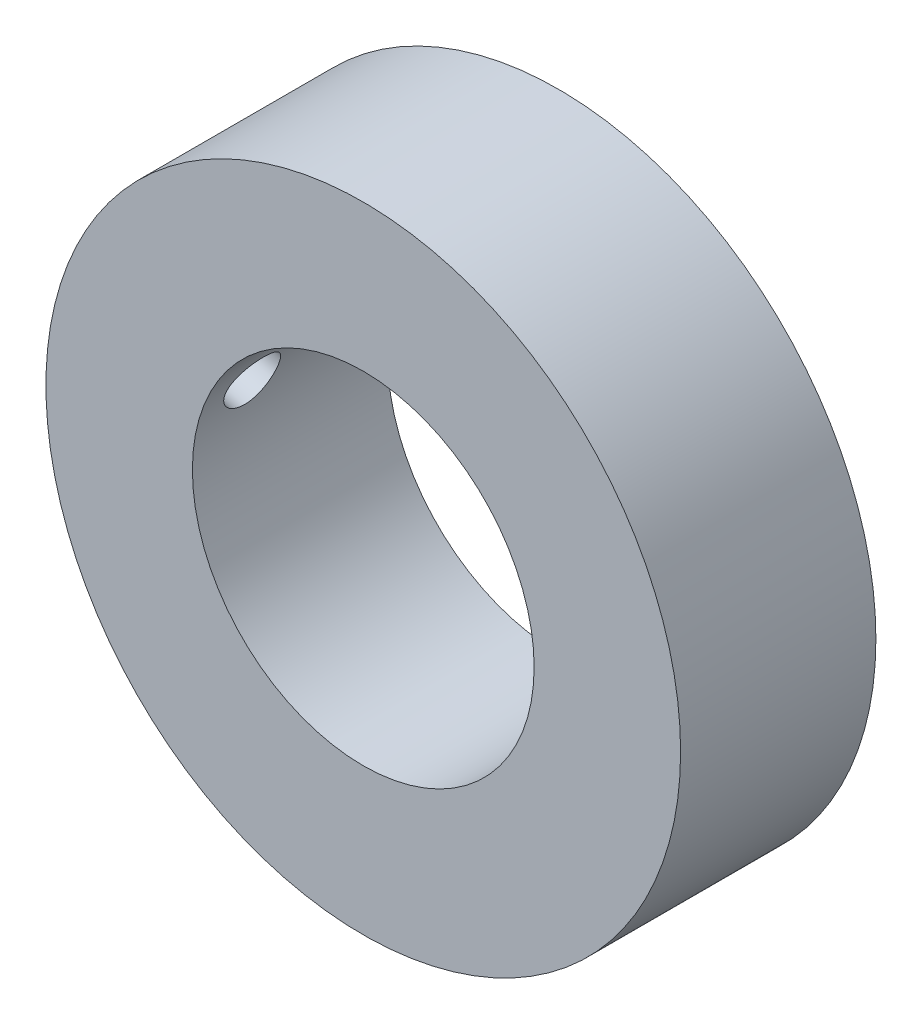
ISO-10303-21;
HEADER;
FILE_DESCRIPTION(('STEP AP214'),'2;1');
FILE_NAME('part.step','',(''),(''),'','','');
FILE_SCHEMA(('AUTOMOTIVE_DESIGN { 1 0 10303 214 1 1 1 1 }'));
ENDSEC;
DATA;
#1=APPLICATION_CONTEXT('core data for automotive mechanical design processes');
#2=APPLICATION_PROTOCOL_DEFINITION('international standard','automotive_design',2000,#1);
#3=PRODUCT_CONTEXT('',#1,'mechanical');
#4=PRODUCT('Part','Part','',(#3));
#5=PRODUCT_RELATED_PRODUCT_CATEGORY('part','',(#4));
#6=PRODUCT_DEFINITION_FORMATION('','',#4);
#7=PRODUCT_DEFINITION_CONTEXT('part definition',#1,'design');
#8=PRODUCT_DEFINITION('design','',#6,#7);
#9=PRODUCT_DEFINITION_SHAPE('','',#8);
#10=(LENGTH_UNIT() NAMED_UNIT(*) SI_UNIT(.MILLI.,.METRE.));
#11=(NAMED_UNIT(*) PLANE_ANGLE_UNIT() SI_UNIT($,.RADIAN.));
#12=(NAMED_UNIT(*) SI_UNIT($,.STERADIAN.) SOLID_ANGLE_UNIT());
#13=UNCERTAINTY_MEASURE_WITH_UNIT(LENGTH_MEASURE(1.E-05),#10,'distance_accuracy_value','');
#14=(GEOMETRIC_REPRESENTATION_CONTEXT(3) GLOBAL_UNCERTAINTY_ASSIGNED_CONTEXT((#13)) GLOBAL_UNIT_ASSIGNED_CONTEXT((#10,
#11,#12)) REPRESENTATION_CONTEXT('',''));
#15=CARTESIAN_POINT('',(0.,0.,0.));
#16=DIRECTION('',(0.,0.,1.));
#17=DIRECTION('',(1.,0.,0.));
#18=AXIS2_PLACEMENT_3D('',#15,#16,#17);
#19=CARTESIAN_POINT('',(0.,0.,20.));
#20=DIRECTION('',(0.,0.,1.));
#21=DIRECTION('',(1.,0.,0.));
#22=AXIS2_PLACEMENT_3D('',#19,#20,#21);
#23=PLANE('',#22);
#24=CARTESIAN_POINT('',(0.,0.,20.));
#25=DIRECTION('',(0.,0.,1.));
#26=DIRECTION('',(1.,0.,0.));
#27=AXIS2_PLACEMENT_3D('',#24,#25,#26);
#28=CIRCLE('',#27,32.5);
#29=CARTESIAN_POINT('',(32.5,0.,20.));
#30=VERTEX_POINT('',#29);
#31=EDGE_CURVE('E10',#30,#30,#28,.T.);
#32=ORIENTED_EDGE('',*,*,#31,.T.);
#33=EDGE_LOOP('',(#32));
#34=FACE_BOUND('',#33,.T.);
#35=CARTESIAN_POINT('',(0.,0.,20.));
#36=DIRECTION('',(0.,0.,1.));
#37=DIRECTION('',(1.,0.,0.));
#38=AXIS2_PLACEMENT_3D('',#35,#36,#37);
#39=CIRCLE('',#38,17.5);
#40=CARTESIAN_POINT('',(17.5,0.,20.));
#41=VERTEX_POINT('',#40);
#42=EDGE_CURVE('E41',#41,#41,#39,.T.);
#43=ORIENTED_EDGE('',*,*,#42,.F.);
#44=EDGE_LOOP('',(#43));
#45=FACE_BOUND('',#44,.T.);
#46=ADVANCED_FACE('F29',(#34,#45),#23,.T.);
#47=CARTESIAN_POINT('',(0.,0.,0.));
#48=DIRECTION('',(0.,0.,1.));
#49=DIRECTION('',(1.,0.,0.));
#50=AXIS2_PLACEMENT_3D('',#47,#48,#49);
#51=PLANE('',#50);
#52=CARTESIAN_POINT('',(0.,0.,0.));
#53=DIRECTION('',(0.,0.,1.));
#54=DIRECTION('',(1.,0.,0.));
#55=AXIS2_PLACEMENT_3D('',#52,#53,#54);
#56=CIRCLE('',#55,32.5);
#57=CARTESIAN_POINT('',(32.5,0.,0.));
#58=VERTEX_POINT('',#57);
#59=EDGE_CURVE('E34',#58,#58,#56,.T.);
#60=ORIENTED_EDGE('',*,*,#59,.F.);
#61=EDGE_LOOP('',(#60));
#62=FACE_BOUND('',#61,.T.);
#63=CARTESIAN_POINT('',(0.,0.,0.));
#64=DIRECTION('',(0.,0.,1.));
#65=DIRECTION('',(1.,0.,0.));
#66=AXIS2_PLACEMENT_3D('',#63,#64,#65);
#67=CIRCLE('',#66,17.5);
#68=CARTESIAN_POINT('',(17.5,0.,0.));
#69=VERTEX_POINT('',#68);
#70=EDGE_CURVE('E43',#69,#69,#67,.T.);
#71=ORIENTED_EDGE('',*,*,#70,.T.);
#72=EDGE_LOOP('',(#71));
#73=FACE_BOUND('',#72,.T.);
#74=ADVANCED_FACE('F70',(#62,#73),#51,.F.);
#75=CARTESIAN_POINT('',(0.,0.,20.));
#76=DIRECTION('',(0.,0.,-1.));
#77=DIRECTION('',(-1.,0.,0.));
#78=AXIS2_PLACEMENT_3D('',#75,#76,#77);
#79=CYLINDRICAL_SURFACE('',#78,32.5);
#80=CARTESIAN_POINT('',(-31.6580099535561,7.34985753471055,15.));
#81=CARTESIAN_POINT('',(-31.6580093802729,7.34986428908865,14.8455507950187));
#82=CARTESIAN_POINT('',(-31.6550638377086,7.36258326980799,14.6909969096927));
#83=CARTESIAN_POINT('',(-31.6432667922846,7.41311771583208,14.3861564829485));
#84=CARTESIAN_POINT('',(-31.6344086225891,7.45096151058809,14.2358749585229));
#85=CARTESIAN_POINT('',(-31.6107756192043,7.55059408325607,13.9440289830093));
#86=CARTESIAN_POINT('',(-31.5960035757084,7.61237156869713,13.8024604573769));
#87=CARTESIAN_POINT('',(-31.5605619112965,7.75799719400248,13.5320250370912));
#88=CARTESIAN_POINT('',(-31.539893624076,7.84184034241233,13.4031552789107));
#89=CARTESIAN_POINT('',(-31.4927338134435,8.02913562949807,13.1616758419426));
#90=CARTESIAN_POINT('',(-31.4662398270969,8.13259605922998,13.0490730738244));
#91=CARTESIAN_POINT('',(-31.4076444252093,8.35602665612486,12.8433906633212));
#92=CARTESIAN_POINT('',(-31.3755428546516,8.47599727967805,12.7503115608071));
#93=CARTESIAN_POINT('',(-31.3061620299281,8.72876580587809,12.5864119884151));
#94=CARTESIAN_POINT('',(-31.2688878887837,8.86155100247904,12.5155697605134));
#95=CARTESIAN_POINT('',(-31.1897641710468,9.1361372622676,12.398032072969));
#96=CARTESIAN_POINT('',(-31.1479146782972,9.27793816022355,12.3513361709373));
#97=CARTESIAN_POINT('',(-31.0606081911833,9.56615063482706,12.2834598743729));
#98=CARTESIAN_POINT('',(-31.0151579534276,9.71255327896088,12.2622328435693));
#99=CARTESIAN_POINT('',(-30.9217307108764,10.0060121502412,12.2456958992536));
#100=CARTESIAN_POINT('',(-30.8737537011059,10.1530683786739,12.2503860367711));
#101=CARTESIAN_POINT('',(-30.7766081165035,10.4438461426784,12.28551130667));
#102=CARTESIAN_POINT('',(-30.7274383105494,10.5875639046104,12.3159742427209));
#103=CARTESIAN_POINT('',(-30.6295400089768,10.8675336598563,12.4017673590155));
#104=CARTESIAN_POINT('',(-30.5808115283041,11.0037854011098,12.4570983782508));
#105=CARTESIAN_POINT('',(-30.4852732319771,11.2657743768856,12.5913724261544));
#106=CARTESIAN_POINT('',(-30.4384738968807,11.3914572684525,12.6704289495366));
#107=CARTESIAN_POINT('',(-30.3488267571219,11.6281882373069,12.8498330412042));
#108=CARTESIAN_POINT('',(-30.3059790603163,11.7392359151742,12.9501811903798));
#109=CARTESIAN_POINT('',(-30.225843923756,11.9440579125522,13.169738923299));
#110=CARTESIAN_POINT('',(-30.1885749186195,12.0377751943826,13.2890084697985));
#111=CARTESIAN_POINT('',(-30.1213775432119,12.2049481277447,13.5428387293097));
#112=CARTESIAN_POINT('',(-30.0914490180463,12.2784042068205,13.6773991195753));
#113=CARTESIAN_POINT('',(-30.0403955941604,12.4027882972028,13.9574604838955));
#114=CARTESIAN_POINT('',(-30.0192367653618,12.4538031817379,14.1029166714446));
#115=CARTESIAN_POINT('',(-29.9865535514953,12.5322955231584,14.4010804687608));
#116=CARTESIAN_POINT('',(-29.9750286378317,12.5597742714312,14.5537876801913));
#117=CARTESIAN_POINT('',(-29.9622228044505,12.5902931139594,14.8607874754793));
#118=CARTESIAN_POINT('',(-29.960859320166,12.5935301799779,15.015057059526));
#119=CARTESIAN_POINT('',(-29.9682238328854,12.5759948946539,15.3219791010538));
#120=CARTESIAN_POINT('',(-29.9769515897467,12.555223114653,15.4746315969296));
#121=CARTESIAN_POINT('',(-30.0040356860676,12.4903586419519,15.773488231737));
#122=CARTESIAN_POINT('',(-30.0223610252911,12.446341029602,15.9197114983901));
#123=CARTESIAN_POINT('',(-30.0677689959859,12.3362390228379,16.2021454430763));
#124=CARTESIAN_POINT('',(-30.094851891867,12.2701539621575,16.3383558186461));
#125=CARTESIAN_POINT('',(-30.1567318487497,12.1172742883074,16.597722329548));
#126=CARTESIAN_POINT('',(-30.1915704077724,12.0303680697547,16.7208027632359));
#127=CARTESIAN_POINT('',(-30.2673734109329,11.838358589614,16.9496696632692));
#128=CARTESIAN_POINT('',(-30.3083381476226,11.7332544589579,17.055455303207));
#129=CARTESIAN_POINT('',(-30.3950587973819,11.5067455362582,17.2475784455559));
#130=CARTESIAN_POINT('',(-30.440849425856,11.3852205707611,17.3337586466911));
#131=CARTESIAN_POINT('',(-30.5351722595844,11.1297695341231,17.4831941857703));
#132=CARTESIAN_POINT('',(-30.5837044971228,10.9958433169385,17.5464492536926));
#133=CARTESIAN_POINT('',(-30.6818346392059,10.7189837451152,17.6483116956977));
#134=CARTESIAN_POINT('',(-30.731434287775,10.5760347734429,17.6868749712148));
#135=CARTESIAN_POINT('',(-30.8299448957378,10.2853312658506,17.7380183873072));
#136=CARTESIAN_POINT('',(-30.8788558721176,10.1375768487543,17.7505991698538));
#137=CARTESIAN_POINT('',(-30.9742879811917,9.84212775161306,17.74935962197));
#138=CARTESIAN_POINT('',(-31.0208187050486,9.69443568368829,17.7356555184329));
#139=CARTESIAN_POINT('',(-31.1104824343818,9.40272166294711,17.6824180050779));
#140=CARTESIAN_POINT('',(-31.1536155148124,9.25869962921478,17.6428851652378));
#141=CARTESIAN_POINT('',(-31.2353435898079,8.9791122469227,17.5393074892844));
#142=CARTESIAN_POINT('',(-31.2739563822936,8.84351479159511,17.4753633234038));
#143=CARTESIAN_POINT('',(-31.3461502726266,8.58411392081663,17.3247609469892));
#144=CARTESIAN_POINT('',(-31.3797315456354,8.46031009485069,17.238103527457));
#145=CARTESIAN_POINT('',(-31.4414091674762,8.22813739147064,17.0445310623412));
#146=CARTESIAN_POINT('',(-31.4695054889975,8.11976859091136,16.9376159158956));
#147=CARTESIAN_POINT('',(-31.5199617345584,7.92164714804217,16.7065206255451));
#148=CARTESIAN_POINT('',(-31.5423202698188,7.83189901370036,16.582336312989));
#149=CARTESIAN_POINT('',(-31.581220883417,7.67353720771558,16.3199388996383));
#150=CARTESIAN_POINT('',(-31.5977491932332,7.60497361168338,16.181693570649));
#151=CARTESIAN_POINT('',(-31.6248725554863,7.49138685479662,15.8954294275032));
#152=CARTESIAN_POINT('',(-31.6354742685854,7.44633727128738,15.7474217948865));
#153=CARTESIAN_POINT('',(-31.6480877797769,7.39249507888641,15.4988025747701));
#154=CARTESIAN_POINT('',(-31.6518080802968,7.37652810554525,15.399769262644));
#155=CARTESIAN_POINT('',(-31.6567693531161,7.35520714157473,15.2005053416351));
#156=CARTESIAN_POINT('',(-31.658010325755,7.34985314949238,15.1002747329162));
#157=CARTESIAN_POINT('',(-31.6580099535561,7.34985753471055,15.));
#158=B_SPLINE_CURVE_WITH_KNOTS('',3,(#80,#81,#82,#83,#84,#85,#86,#87,#88,#89,#90,#91,#92,#93,
#94,#95,#96,#97,#98,#99,#100,#101,#102,#103,#104,#105,#106,#107,#108,#109,#110,#111,#112,#113,
#114,#115,#116,#117,#118,#119,#120,#121,#122,#123,#124,#125,#126,#127,#128,#129,#130,#131,#132,
#133,#134,#135,#136,#137,#138,#139,#140,#141,#142,#143,#144,#145,#146,#147,#148,#149,#150,#151,
#152,#153,#154,#155,#156,#157),.UNSPECIFIED.,.T.,.F.,(4,2,2,2,2,2,2,2,2,2,2,2,2,2,2,2,2,2,2,2,2,
2,2,2,2,2,2,2,2,2,2,2,2,2,2,2,2,2,4),(0.,0.46298232345098,0.926487570631496,1.38977439109223,
1.85295650178824,2.31633481007994,2.77972593008149,3.2426622140073,3.70559001609808,
4.16766884705827,4.62974858782844,5.09232745633577,5.55492193235533,6.01976556469957,
6.48462188080152,6.95098190960408,7.41733209670479,7.88186073477829,8.3463638833287,
8.80708865099173,9.26780245495647,9.72703724609879,10.1862859038319,10.6480535788622,
11.1098433123745,11.575216831378,12.0405958315624,12.5068036788629,12.9730000070371,
13.4371396529722,13.901269056812,14.363504752721,14.8257243531523,15.2879462550091,
15.750279928188,16.2136982407338,16.6765946837254,16.9771817614673,17.2777687980568),.UNSPECIFIED.);
#159=CARTESIAN_POINT('',(-31.6580099535561,7.34985753471055,15.));
#160=VERTEX_POINT('',#159);
#161=EDGE_CURVE('E46',#160,#160,#158,.T.);
#162=ORIENTED_EDGE('',*,*,#161,.T.);
#163=EDGE_LOOP('',(#162));
#164=FACE_BOUND('',#163,.T.);
#165=ORIENTED_EDGE('',*,*,#31,.F.);
#166=EDGE_LOOP('',(#165));
#167=FACE_BOUND('',#166,.T.);
#168=ORIENTED_EDGE('',*,*,#59,.T.);
#169=EDGE_LOOP('',(#168));
#170=FACE_BOUND('',#169,.T.);
#171=ADVANCED_FACE('F31',(#164,#167,#170),#79,.T.);
#172=CARTESIAN_POINT('',(0.,0.,20.));
#173=DIRECTION('',(0.,0.,-1.));
#174=DIRECTION('',(-1.,0.,0.));
#175=AXIS2_PLACEMENT_3D('',#172,#173,#174);
#176=CYLINDRICAL_SURFACE('',#175,17.5);
#177=CARTESIAN_POINT('',(-17.1538427916572,3.46347765679383,15.));
#178=CARTESIAN_POINT('',(-17.1538431757249,3.4634840686539,14.8455986319449));
#179=CARTESIAN_POINT('',(-17.15127053917,3.47629362486233,14.6911104193291));
#180=CARTESIAN_POINT('',(-17.1408811916489,3.52715764027573,14.3864261901741));
#181=CARTESIAN_POINT('',(-17.1330595232561,3.5652359640849,14.2362343712865));
#182=CARTESIAN_POINT('',(-17.1119073461127,3.66541021239581,13.9445638722195));
#183=CARTESIAN_POINT('',(-17.0985793515415,3.72749517467879,13.8030812492678));
#184=CARTESIAN_POINT('',(-17.066045754254,3.8737146891507,13.5327852707804));
#185=CARTESIAN_POINT('',(-17.0468411608176,3.9578454547141,13.4039697447426));
#186=CARTESIAN_POINT('',(-17.0021413528646,4.14565932595845,13.1624646427161));
#187=CARTESIAN_POINT('',(-16.9766385777326,4.24936589577674,13.0497947073951));
#188=CARTESIAN_POINT('',(-16.919073368241,4.47305989625865,12.8439760738533));
#189=CARTESIAN_POINT('',(-16.887010939175,4.59304731378363,12.750827359879));
#190=CARTESIAN_POINT('',(-16.8163994315888,4.84517973059899,12.5869992452294));
#191=CARTESIAN_POINT('',(-16.7778722663549,4.97728299736405,12.516246194212));
#192=CARTESIAN_POINT('',(-16.6945635438269,5.2499375900001,12.3988012865267));
#193=CARTESIAN_POINT('',(-16.6497823440893,5.39048843264351,12.3521080550222));
#194=CARTESIAN_POINT('',(-16.55499722898,5.67489066182067,12.2842570185654));
#195=CARTESIAN_POINT('',(-16.5050277811698,5.81871586291687,12.2629411118536));
#196=CARTESIAN_POINT('',(-16.4007987447213,6.1063242061179,12.245767969512));
#197=CARTESIAN_POINT('',(-16.3465391092262,6.25010734774615,12.2499110119788));
#198=CARTESIAN_POINT('',(-16.2350986054313,6.53413624264609,12.283403291648));
#199=CARTESIAN_POINT('',(-16.1779079744968,6.67436748922324,12.3128427142704));
#200=CARTESIAN_POINT('',(-16.0626988792506,6.94705937098128,12.3960410295795));
#201=CARTESIAN_POINT('',(-16.0046803292226,7.07951919420556,12.4498024583306));
#202=CARTESIAN_POINT('',(-15.889020078903,7.33546884215141,12.5811532971801));
#203=CARTESIAN_POINT('',(-15.8314005545206,7.45877365558503,12.6591227917611));
#204=CARTESIAN_POINT('',(-15.7199448906926,7.6908996282412,12.8364224884093));
#205=CARTESIAN_POINT('',(-15.6661091514693,7.79971925640753,12.9357549456026));
#206=CARTESIAN_POINT('',(-15.564079445905,8.0013985057883,13.1544781099933));
#207=CARTESIAN_POINT('',(-15.5159605046165,8.09405208491283,13.2740941189949));
#208=CARTESIAN_POINT('',(-15.4286000939903,8.25936252399722,13.5293298933557));
#209=CARTESIAN_POINT('',(-15.3893580091342,8.33202077050308,13.6649485481036));
#210=CARTESIAN_POINT('',(-15.3223946704901,8.45452883012101,13.9466227319526));
#211=CARTESIAN_POINT('',(-15.2945335260708,8.50465640292055,14.0925239635386));
#212=CARTESIAN_POINT('',(-15.2513004404302,8.58194733676186,14.3920507121201));
#213=CARTESIAN_POINT('',(-15.2359258804932,8.60911551295031,14.5456746023212));
#214=CARTESIAN_POINT('',(-15.2188840954723,8.63920468237549,14.8515427579398));
#215=CARTESIAN_POINT('',(-15.2168355387572,8.64280024417644,15.003699734682));
#216=CARTESIAN_POINT('',(-15.2255562658,8.62742793329527,15.3064889366321));
#217=CARTESIAN_POINT('',(-15.2363245504515,8.60846181935492,15.4571212797662));
#218=CARTESIAN_POINT('',(-15.2698205636023,8.54890134944482,15.7507632519136));
#219=CARTESIAN_POINT('',(-15.2924049207332,8.50856620418694,15.8938421042997));
#220=CARTESIAN_POINT('',(-15.3481663859908,8.40756189958086,16.1704306259361));
#221=CARTESIAN_POINT('',(-15.3813445063609,8.34689079708661,16.3039393792618));
#222=CARTESIAN_POINT('',(-15.4572619944732,8.20546101347621,16.560380323916));
#223=CARTESIAN_POINT('',(-15.5001702925809,8.1243441901941,16.6830647877217));
#224=CARTESIAN_POINT('',(-15.5930327887161,7.94465460084475,16.9118692217591));
#225=CARTESIAN_POINT('',(-15.6429881065378,7.84607905989335,17.0179865537629));
#226=CARTESIAN_POINT('',(-15.749109767236,7.63087800974491,17.2136680548445));
#227=CARTESIAN_POINT('',(-15.8054091458389,7.51383063316745,17.3026966880032));
#228=CARTESIAN_POINT('',(-15.9205634504183,7.26665186312331,17.4580612650728));
#229=CARTESIAN_POINT('',(-15.9794185141391,7.13651976392855,17.5243959841309));
#230=CARTESIAN_POINT('',(-16.0977376239701,6.8654820536981,17.6328352752871));
#231=CARTESIAN_POINT('',(-16.1572029898806,6.72450511115865,17.6747605117513));
#232=CARTESIAN_POINT('',(-16.2740948201831,6.43645694940481,17.7322240143153));
#233=CARTESIAN_POINT('',(-16.3315214716609,6.2893862920878,17.7477647077941));
#234=CARTESIAN_POINT('',(-16.4416267145981,5.99559491735699,17.7517562987542));
#235=CARTESIAN_POINT('',(-16.4943630242819,5.84890126891833,17.740604945473));
#236=CARTESIAN_POINT('',(-16.5946235716075,5.55806879582432,17.6921826922283));
#237=CARTESIAN_POINT('',(-16.6421482500082,5.41392975598591,17.6549140030379));
#238=CARTESIAN_POINT('',(-16.7303988487478,5.13467697855945,17.5559769523923));
#239=CARTESIAN_POINT('',(-16.7712139183587,4.99946218042478,17.4946728540267));
#240=CARTESIAN_POINT('',(-16.846418621225,4.73987981196288,17.3493736646492));
#241=CARTESIAN_POINT('',(-16.8808084374352,4.61551193283075,17.2653792198961));
#242=CARTESIAN_POINT('',(-16.9430718706297,4.38143871094692,17.0771102377847));
#243=CARTESIAN_POINT('',(-16.9709479184203,4.27172790503972,16.9728432924101));
#244=CARTESIAN_POINT('',(-17.0204027824758,4.07021896273108,16.746910226799));
#245=CARTESIAN_POINT('',(-17.0419801738769,3.97842488095287,16.625240178944));
#246=CARTESIAN_POINT('',(-17.0793068209078,3.81501944518119,16.367031953621));
#247=CARTESIAN_POINT('',(-17.0950148075793,3.74355181869168,16.2303969195188));
#248=CARTESIAN_POINT('',(-17.1207719308083,3.62394014341457,15.9468811173658));
#249=CARTESIAN_POINT('',(-17.1308263475508,3.57577433764537,15.8000100539216));
#250=CARTESIAN_POINT('',(-17.1434568138225,3.51461698250209,15.5438275075456));
#251=CARTESIAN_POINT('',(-17.1473570801633,3.49547095603032,15.4360066387467));
#252=CARTESIAN_POINT('',(-17.1525499310198,3.46989903072337,15.2188050511444));
#253=CARTESIAN_POINT('',(-17.1538425194682,3.46347311270506,15.1094243346935));
#254=CARTESIAN_POINT('',(-17.1538427916572,3.46347765679383,15.));
#255=B_SPLINE_CURVE_WITH_KNOTS('',3,(#177,#178,#179,#180,#181,#182,#183,#184,#185,#186,#187,
#188,#189,#190,#191,#192,#193,#194,#195,#196,#197,#198,#199,#200,#201,#202,#203,#204,#205,#206,
#207,#208,#209,#210,#211,#212,#213,#214,#215,#216,#217,#218,#219,#220,#221,#222,#223,#224,#225,
#226,#227,#228,#229,#230,#231,#232,#233,#234,#235,#236,#237,#238,#239,#240,#241,#242,#243,#244,
#245,#246,#247,#248,#249,#250,#251,#252,#253,#254),.UNSPECIFIED.,.T.,.F.,(4,2,2,2,2,2,2,2,2,2,2,
2,2,2,2,2,2,2,2,2,2,2,2,2,2,2,2,2,2,2,2,2,2,2,2,2,2,2,4),(0.,0.462807231454876,
0.926052175595458,1.38908583622576,1.85204001746059,2.31555267403756,2.77906495656193,
3.24103670367023,3.70298204966426,4.16203414062792,4.6210912459791,5.08179178199589,
5.54254036650017,6.01092388594696,6.47935687338578,6.95338208969828,7.42737442716419,
7.89535132100097,8.36323004427022,8.81765894033372,9.27205241479479,9.72105612414693,
10.1701027490409,10.6276403741433,11.0852507855274,11.5554469692095,12.0256685266683,
12.4993025566766,12.9728930099769,13.4394703357202,13.9060081715227,14.3657330232121,
14.8254447825511,15.2849847118295,15.7446285164815,16.2074459283859,16.6698303682097,
16.9978226030254,17.3258143431972),.UNSPECIFIED.);
#256=CARTESIAN_POINT('',(-17.1538427916572,3.46347765679383,15.));
#257=VERTEX_POINT('',#256);
#258=EDGE_CURVE('E54',#257,#257,#255,.T.);
#259=ORIENTED_EDGE('',*,*,#258,.F.);
#260=EDGE_LOOP('',(#259));
#261=FACE_BOUND('',#260,.T.);
#262=ORIENTED_EDGE('',*,*,#42,.T.);
#263=EDGE_LOOP('',(#262));
#264=FACE_BOUND('',#263,.T.);
#265=ORIENTED_EDGE('',*,*,#70,.F.);
#266=EDGE_LOOP('',(#265));
#267=FACE_BOUND('',#266,.T.);
#268=ADVANCED_FACE('F61',(#261,#264,#267),#176,.F.);
#269=CARTESIAN_POINT('',(-40.5825504550231,12.5881904510251,15.));
#270=DIRECTION('',(-0.96592582628907,0.258819045102514,0.));
#271=DIRECTION('',(-0.258819045102514,-0.96592582628907,0.));
#272=AXIS2_PLACEMENT_3D('',#269,#270,#271);
#273=CYLINDRICAL_SURFACE('',#272,2.74999999999999);
#274=ORIENTED_EDGE('',*,*,#258,.T.);
#275=EDGE_LOOP('',(#274));
#276=FACE_BOUND('',#275,.T.);
#277=ORIENTED_EDGE('',*,*,#161,.F.);
#278=EDGE_LOOP('',(#277));
#279=FACE_BOUND('',#278,.T.);
#280=ADVANCED_FACE('F58',(#276,#279),#273,.F.);
#281=CLOSED_SHELL('',(#46,#74,#171,#268,#280));
#282=MANIFOLD_SOLID_BREP('B2',#281);
#283=ADVANCED_BREP_SHAPE_REPRESENTATION('',(#18,#282),#14);
#284=SHAPE_DEFINITION_REPRESENTATION(#9,#283);
ENDSEC;
END-ISO-10303-21;
